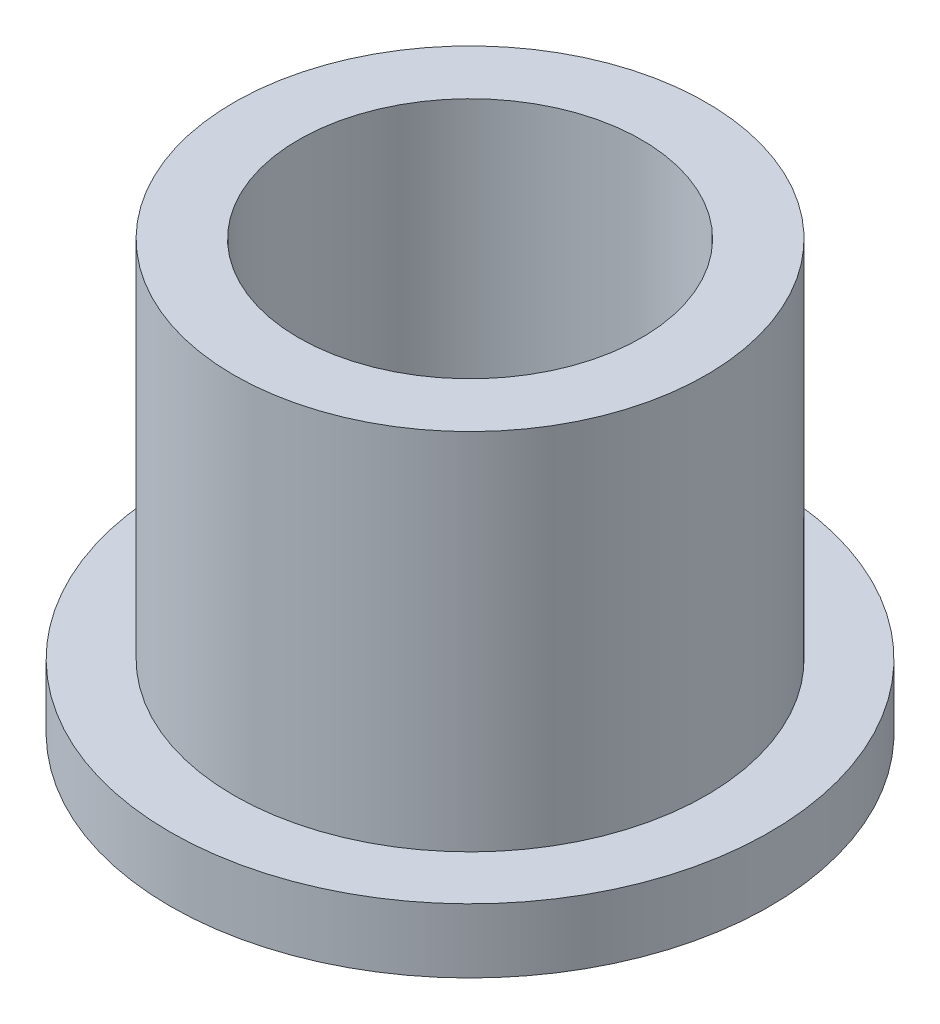
ISO-10303-21;
HEADER;
FILE_DESCRIPTION(('STEP AP214'),'2;1');
FILE_NAME('part.step','',(''),(''),'','','');
FILE_SCHEMA(('AUTOMOTIVE_DESIGN { 1 0 10303 214 1 1 1 1 }'));
ENDSEC;
DATA;
#1=APPLICATION_CONTEXT('core data for automotive mechanical design processes');
#2=APPLICATION_PROTOCOL_DEFINITION('international standard','automotive_design',2000,#1);
#3=PRODUCT_CONTEXT('',#1,'mechanical');
#4=PRODUCT('Part','Part','',(#3));
#5=PRODUCT_RELATED_PRODUCT_CATEGORY('part','',(#4));
#6=PRODUCT_DEFINITION_FORMATION('','',#4);
#7=PRODUCT_DEFINITION_CONTEXT('part definition',#1,'design');
#8=PRODUCT_DEFINITION('design','',#6,#7);
#9=PRODUCT_DEFINITION_SHAPE('','',#8);
#10=(LENGTH_UNIT() NAMED_UNIT(*) SI_UNIT(.MILLI.,.METRE.));
#11=(NAMED_UNIT(*) PLANE_ANGLE_UNIT() SI_UNIT($,.RADIAN.));
#12=(NAMED_UNIT(*) SI_UNIT($,.STERADIAN.) SOLID_ANGLE_UNIT());
#13=UNCERTAINTY_MEASURE_WITH_UNIT(LENGTH_MEASURE(1.E-05),#10,'distance_accuracy_value','');
#14=(GEOMETRIC_REPRESENTATION_CONTEXT(3) GLOBAL_UNCERTAINTY_ASSIGNED_CONTEXT((#13)) GLOBAL_UNIT_ASSIGNED_CONTEXT((#10,
#11,#12)) REPRESENTATION_CONTEXT('',''));
#15=CARTESIAN_POINT('',(0.,0.,0.));
#16=DIRECTION('',(0.,0.,1.));
#17=DIRECTION('',(1.,0.,0.));
#18=AXIS2_PLACEMENT_3D('',#15,#16,#17);
#19=CARTESIAN_POINT('',(0.,10.,0.));
#20=DIRECTION('',(0.,1.,0.));
#21=DIRECTION('',(0.,0.,1.));
#22=AXIS2_PLACEMENT_3D('',#19,#20,#21);
#23=PLANE('',#22);
#24=CARTESIAN_POINT('',(0.,10.,0.));
#25=DIRECTION('',(0.,1.,0.));
#26=DIRECTION('',(0.,0.,1.));
#27=AXIS2_PLACEMENT_3D('',#24,#25,#26);
#28=CIRCLE('',#27,5.515);
#29=CARTESIAN_POINT('',(0.,10.,5.515));
#30=VERTEX_POINT('',#29);
#31=EDGE_CURVE('E10',#30,#30,#28,.T.);
#32=ORIENTED_EDGE('',*,*,#31,.T.);
#33=EDGE_LOOP('',(#32));
#34=FACE_BOUND('',#33,.T.);
#35=CARTESIAN_POINT('',(0.,10.,0.));
#36=DIRECTION('',(0.,1.,0.));
#37=DIRECTION('',(0.,0.,1.));
#38=AXIS2_PLACEMENT_3D('',#35,#36,#37);
#39=CIRCLE('',#38,4.005);
#40=CARTESIAN_POINT('',(0.,10.,4.005));
#41=VERTEX_POINT('',#40);
#42=EDGE_CURVE('E37',#41,#41,#39,.T.);
#43=ORIENTED_EDGE('',*,*,#42,.F.);
#44=EDGE_LOOP('',(#43));
#45=FACE_BOUND('',#44,.T.);
#46=ADVANCED_FACE('F30',(#34,#45),#23,.T.);
#47=CARTESIAN_POINT('',(0.,0.,0.));
#48=DIRECTION('',(0.,1.,0.));
#49=DIRECTION('',(0.,0.,1.));
#50=AXIS2_PLACEMENT_3D('',#47,#48,#49);
#51=PLANE('',#50);
#52=CARTESIAN_POINT('',(0.,0.,0.));
#53=DIRECTION('',(0.,1.,0.));
#54=DIRECTION('',(0.,0.,1.));
#55=AXIS2_PLACEMENT_3D('',#52,#53,#54);
#56=CIRCLE('',#55,4.005);
#57=CARTESIAN_POINT('',(0.,0.,4.005));
#58=VERTEX_POINT('',#57);
#59=EDGE_CURVE('E41',#58,#58,#56,.T.);
#60=ORIENTED_EDGE('',*,*,#59,.T.);
#61=EDGE_LOOP('',(#60));
#62=FACE_BOUND('',#61,.T.);
#63=CARTESIAN_POINT('',(0.,0.,0.));
#64=DIRECTION('',(0.,1.,0.));
#65=DIRECTION('',(0.,0.,1.));
#66=AXIS2_PLACEMENT_3D('',#63,#64,#65);
#67=CIRCLE('',#66,7.);
#68=CARTESIAN_POINT('',(0.,0.,7.));
#69=VERTEX_POINT('',#68);
#70=EDGE_CURVE('E48',#69,#69,#67,.T.);
#71=ORIENTED_EDGE('',*,*,#70,.F.);
#72=EDGE_LOOP('',(#71));
#73=FACE_BOUND('',#72,.T.);
#74=ADVANCED_FACE('F73',(#62,#73),#51,.F.);
#75=CARTESIAN_POINT('',(0.,10.,0.));
#76=DIRECTION('',(0.,-1.,0.));
#77=DIRECTION('',(0.,0.,-1.));
#78=AXIS2_PLACEMENT_3D('',#75,#76,#77);
#79=CYLINDRICAL_SURFACE('',#78,5.515);
#80=CARTESIAN_POINT('',(0.,1.5,0.));
#81=DIRECTION('',(0.,1.,0.));
#82=DIRECTION('',(0.,0.,1.));
#83=AXIS2_PLACEMENT_3D('',#80,#81,#82);
#84=CIRCLE('',#83,5.515);
#85=CARTESIAN_POINT('',(0.,1.5,5.515));
#86=VERTEX_POINT('',#85);
#87=EDGE_CURVE('E51',#86,#86,#84,.T.);
#88=ORIENTED_EDGE('',*,*,#87,.T.);
#89=EDGE_LOOP('',(#88));
#90=FACE_BOUND('',#89,.T.);
#91=ORIENTED_EDGE('',*,*,#31,.F.);
#92=EDGE_LOOP('',(#91));
#93=FACE_BOUND('',#92,.T.);
#94=ADVANCED_FACE('F32',(#90,#93),#79,.T.);
#95=CARTESIAN_POINT('',(0.,10.,0.));
#96=DIRECTION('',(0.,-1.,0.));
#97=DIRECTION('',(0.,0.,-1.));
#98=AXIS2_PLACEMENT_3D('',#95,#96,#97);
#99=CYLINDRICAL_SURFACE('',#98,4.005);
#100=ORIENTED_EDGE('',*,*,#42,.T.);
#101=EDGE_LOOP('',(#100));
#102=FACE_BOUND('',#101,.T.);
#103=ORIENTED_EDGE('',*,*,#59,.F.);
#104=EDGE_LOOP('',(#103));
#105=FACE_BOUND('',#104,.T.);
#106=ADVANCED_FACE('F62',(#102,#105),#99,.F.);
#107=CARTESIAN_POINT('',(0.,1.5,0.));
#108=DIRECTION('',(0.,1.,0.));
#109=DIRECTION('',(0.,0.,1.));
#110=AXIS2_PLACEMENT_3D('',#107,#108,#109);
#111=PLANE('',#110);
#112=CARTESIAN_POINT('',(0.,1.5,0.));
#113=DIRECTION('',(0.,1.,0.));
#114=DIRECTION('',(0.,0.,1.));
#115=AXIS2_PLACEMENT_3D('',#112,#113,#114);
#116=CIRCLE('',#115,7.);
#117=CARTESIAN_POINT('',(0.,1.5,7.));
#118=VERTEX_POINT('',#117);
#119=EDGE_CURVE('E46',#118,#118,#116,.T.);
#120=ORIENTED_EDGE('',*,*,#119,.T.);
#121=EDGE_LOOP('',(#120));
#122=FACE_BOUND('',#121,.T.);
#123=ORIENTED_EDGE('',*,*,#87,.F.);
#124=EDGE_LOOP('',(#123));
#125=FACE_BOUND('',#124,.T.);
#126=ADVANCED_FACE('F59',(#122,#125),#111,.T.);
#127=CARTESIAN_POINT('',(0.,1.5,0.));
#128=DIRECTION('',(0.,-1.,0.));
#129=DIRECTION('',(0.,0.,-1.));
#130=AXIS2_PLACEMENT_3D('',#127,#128,#129);
#131=CYLINDRICAL_SURFACE('',#130,7.);
#132=ORIENTED_EDGE('',*,*,#119,.F.);
#133=EDGE_LOOP('',(#132));
#134=FACE_BOUND('',#133,.T.);
#135=ORIENTED_EDGE('',*,*,#70,.T.);
#136=EDGE_LOOP('',(#135));
#137=FACE_BOUND('',#136,.T.);
#138=ADVANCED_FACE('F61',(#134,#137),#131,.T.);
#139=CLOSED_SHELL('',(#46,#74,#94,#106,#126,#138));
#140=MANIFOLD_SOLID_BREP('B2',#139);
#141=ADVANCED_BREP_SHAPE_REPRESENTATION('',(#18,#140),#14);
#142=SHAPE_DEFINITION_REPRESENTATION(#9,#141);
ENDSEC;
END-ISO-10303-21;
